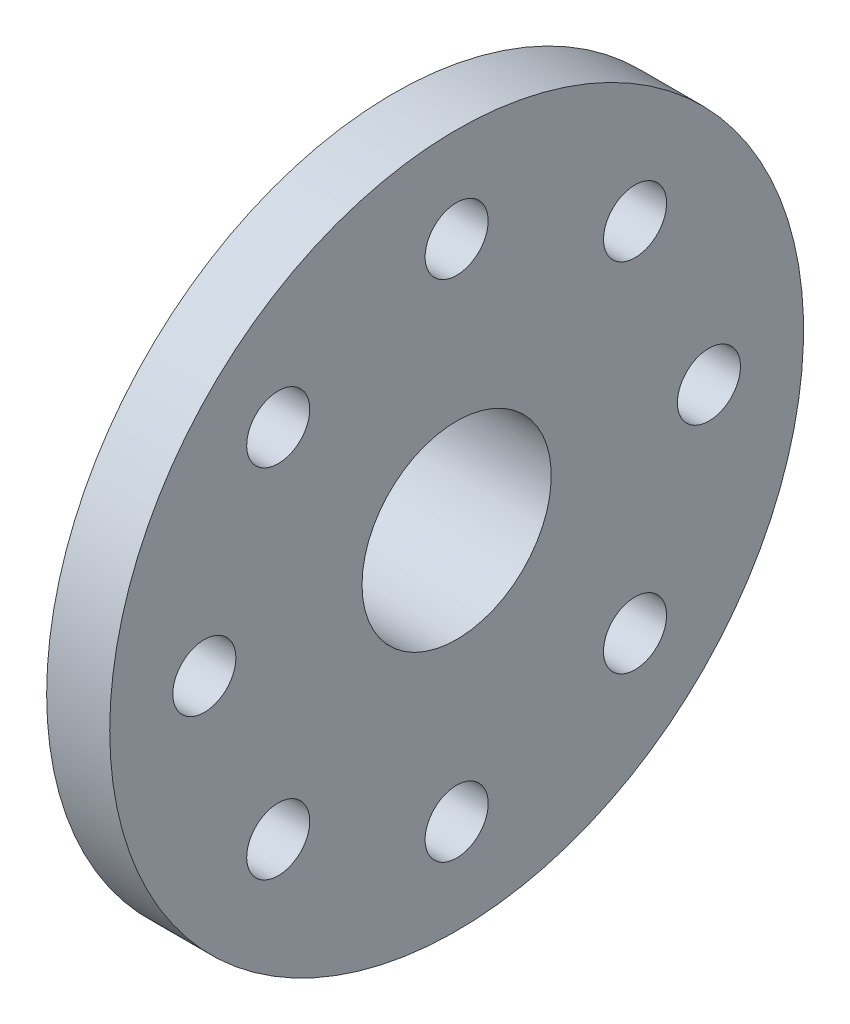
ISO-10303-21;
HEADER;
FILE_DESCRIPTION(('STEP AP214'),'2;1');
FILE_NAME('part.step','',(''),(''),'','','');
FILE_SCHEMA(('AUTOMOTIVE_DESIGN { 1 0 10303 214 1 1 1 1 }'));
ENDSEC;
DATA;
#1=APPLICATION_CONTEXT('core data for automotive mechanical design processes');
#2=APPLICATION_PROTOCOL_DEFINITION('international standard','automotive_design',2000,#1);
#3=PRODUCT_CONTEXT('',#1,'mechanical');
#4=PRODUCT('Part','Part','',(#3));
#5=PRODUCT_RELATED_PRODUCT_CATEGORY('part','',(#4));
#6=PRODUCT_DEFINITION_FORMATION('','',#4);
#7=PRODUCT_DEFINITION_CONTEXT('part definition',#1,'design');
#8=PRODUCT_DEFINITION('design','',#6,#7);
#9=PRODUCT_DEFINITION_SHAPE('','',#8);
#10=(LENGTH_UNIT() NAMED_UNIT(*) SI_UNIT(.MILLI.,.METRE.));
#11=(NAMED_UNIT(*) PLANE_ANGLE_UNIT() SI_UNIT($,.RADIAN.));
#12=(NAMED_UNIT(*) SI_UNIT($,.STERADIAN.) SOLID_ANGLE_UNIT());
#13=UNCERTAINTY_MEASURE_WITH_UNIT(LENGTH_MEASURE(1.E-05),#10,'distance_accuracy_value','');
#14=(GEOMETRIC_REPRESENTATION_CONTEXT(3) GLOBAL_UNCERTAINTY_ASSIGNED_CONTEXT((#13)) GLOBAL_UNIT_ASSIGNED_CONTEXT((#10,
#11,#12)) REPRESENTATION_CONTEXT('',''));
#15=CARTESIAN_POINT('',(0.,0.,0.));
#16=DIRECTION('',(0.,0.,1.));
#17=DIRECTION('',(1.,0.,0.));
#18=AXIS2_PLACEMENT_3D('',#15,#16,#17);
#19=CARTESIAN_POINT('',(1.,3.,0.));
#20=DIRECTION('',(-1.,0.,0.));
#21=DIRECTION('',(0.,0.,1.));
#22=AXIS2_PLACEMENT_3D('',#19,#20,#21);
#23=PLANE('',#22);
#24=CARTESIAN_POINT('',(1.,5.65685424949245,5.65685424949231));
#25=DIRECTION('',(-1.,0.,0.));
#26=DIRECTION('',(0.,-0.707106781186539,0.707106781186556));
#27=AXIS2_PLACEMENT_3D('',#24,#25,#26);
#28=CIRCLE('',#27,1.);
#29=CARTESIAN_POINT('',(1.,4.94974746830591,6.36396103067887));
#30=VERTEX_POINT('',#29);
#31=EDGE_CURVE('E85',#30,#30,#28,.T.);
#32=ORIENTED_EDGE('',*,*,#31,.T.);
#33=EDGE_LOOP('',(#32));
#34=FACE_BOUND('',#33,.T.);
#35=CARTESIAN_POINT('',(1.,0.,8.));
#36=DIRECTION('',(-1.,0.,0.));
#37=DIRECTION('',(0.,-1.,0.));
#38=AXIS2_PLACEMENT_3D('',#35,#36,#37);
#39=CIRCLE('',#38,1.);
#40=CARTESIAN_POINT('',(1.,-0.999999999999916,8.00000000000001));
#41=VERTEX_POINT('',#40);
#42=EDGE_CURVE('E79',#41,#41,#39,.T.);
#43=ORIENTED_EDGE('',*,*,#42,.T.);
#44=EDGE_LOOP('',(#43));
#45=FACE_BOUND('',#44,.T.);
#46=CARTESIAN_POINT('',(1.,-5.65685424949233,5.65685424949243));
#47=DIRECTION('',(-1.,0.,0.));
#48=DIRECTION('',(0.,-0.707106781186554,-0.707106781186541));
#49=AXIS2_PLACEMENT_3D('',#46,#47,#48);
#50=CIRCLE('',#49,1.);
#51=CARTESIAN_POINT('',(1.,-6.36396103067888,4.94974746830589));
#52=VERTEX_POINT('',#51);
#53=EDGE_CURVE('E73',#52,#52,#50,.T.);
#54=ORIENTED_EDGE('',*,*,#53,.T.);
#55=EDGE_LOOP('',(#54));
#56=FACE_BOUND('',#55,.T.);
#57=CARTESIAN_POINT('',(1.,-8.,0.));
#58=DIRECTION('',(-1.,0.,0.));
#59=DIRECTION('',(0.,0.,-1.));
#60=AXIS2_PLACEMENT_3D('',#57,#58,#59);
#61=CIRCLE('',#60,1.);
#62=CARTESIAN_POINT('',(1.,-8.,-1.));
#63=VERTEX_POINT('',#62);
#64=EDGE_CURVE('E67',#63,#63,#61,.T.);
#65=ORIENTED_EDGE('',*,*,#64,.T.);
#66=EDGE_LOOP('',(#65));
#67=FACE_BOUND('',#66,.T.);
#68=CARTESIAN_POINT('',(1.,-5.65685424949241,-5.65685424949235));
#69=DIRECTION('',(-1.,0.,0.));
#70=DIRECTION('',(0.,0.707106781186544,-0.707106781186551));
#71=AXIS2_PLACEMENT_3D('',#68,#69,#70);
#72=CIRCLE('',#71,1.);
#73=CARTESIAN_POINT('',(1.,-4.94974746830587,-6.3639610306789));
#74=VERTEX_POINT('',#73);
#75=EDGE_CURVE('E61',#74,#74,#72,.T.);
#76=ORIENTED_EDGE('',*,*,#75,.T.);
#77=EDGE_LOOP('',(#76));
#78=FACE_BOUND('',#77,.T.);
#79=CARTESIAN_POINT('',(1.,0.,-8.));
#80=DIRECTION('',(-1.,0.,0.));
#81=DIRECTION('',(0.,1.,0.));
#82=AXIS2_PLACEMENT_3D('',#79,#80,#81);
#83=CIRCLE('',#82,1.);
#84=CARTESIAN_POINT('',(1.,0.999999999999972,-8.));
#85=VERTEX_POINT('',#84);
#86=EDGE_CURVE('E55',#85,#85,#83,.T.);
#87=ORIENTED_EDGE('',*,*,#86,.T.);
#88=EDGE_LOOP('',(#87));
#89=FACE_BOUND('',#88,.T.);
#90=CARTESIAN_POINT('',(1.,5.65685424949237,-5.65685424949239));
#91=DIRECTION('',(-1.,0.,0.));
#92=DIRECTION('',(0.,0.707106781186549,0.707106781186546));
#93=AXIS2_PLACEMENT_3D('',#90,#91,#92);
#94=CIRCLE('',#93,1.);
#95=CARTESIAN_POINT('',(1.,6.36396103067892,-4.94974746830584));
#96=VERTEX_POINT('',#95);
#97=EDGE_CURVE('E49',#96,#96,#94,.T.);
#98=ORIENTED_EDGE('',*,*,#97,.T.);
#99=EDGE_LOOP('',(#98));
#100=FACE_BOUND('',#99,.T.);
#101=CARTESIAN_POINT('',(1.,8.,0.));
#102=DIRECTION('',(-1.,0.,0.));
#103=DIRECTION('',(0.,0.,1.));
#104=AXIS2_PLACEMENT_3D('',#101,#102,#103);
#105=CIRCLE('',#104,1.);
#106=CARTESIAN_POINT('',(1.,8.,1.));
#107=VERTEX_POINT('',#106);
#108=EDGE_CURVE('E45',#107,#107,#105,.T.);
#109=ORIENTED_EDGE('',*,*,#108,.T.);
#110=EDGE_LOOP('',(#109));
#111=FACE_BOUND('',#110,.T.);
#112=CARTESIAN_POINT('',(1.,0.,0.));
#113=DIRECTION('',(-1.,0.,0.));
#114=DIRECTION('',(0.,0.,1.));
#115=AXIS2_PLACEMENT_3D('',#112,#113,#114);
#116=CIRCLE('',#115,11.);
#117=CARTESIAN_POINT('',(1.,0.,11.));
#118=VERTEX_POINT('',#117);
#119=EDGE_CURVE('E10',#118,#118,#116,.T.);
#120=ORIENTED_EDGE('',*,*,#119,.F.);
#121=EDGE_LOOP('',(#120));
#122=FACE_BOUND('',#121,.T.);
#123=CARTESIAN_POINT('',(1.,0.,0.));
#124=DIRECTION('',(-1.,0.,0.));
#125=DIRECTION('',(0.,0.,1.));
#126=AXIS2_PLACEMENT_3D('',#123,#124,#125);
#127=CIRCLE('',#126,3.);
#128=CARTESIAN_POINT('',(1.,0.,3.));
#129=VERTEX_POINT('',#128);
#130=EDGE_CURVE('E42',#129,#129,#127,.T.);
#131=ORIENTED_EDGE('',*,*,#130,.T.);
#132=EDGE_LOOP('',(#131));
#133=FACE_BOUND('',#132,.T.);
#134=ADVANCED_FACE('F14',(#34,#45,#56,#67,#78,#89,#100,#111,#122,#133),#23,.F.);
#135=CARTESIAN_POINT('',(0.,0.,0.));
#136=DIRECTION('',(-1.,0.,0.));
#137=DIRECTION('',(0.,0.,1.));
#138=AXIS2_PLACEMENT_3D('',#135,#136,#137);
#139=CYLINDRICAL_SURFACE('',#138,11.);
#140=CARTESIAN_POINT('',(-1.,0.,0.));
#141=DIRECTION('',(-1.,0.,0.));
#142=DIRECTION('',(0.,0.,1.));
#143=AXIS2_PLACEMENT_3D('',#140,#141,#142);
#144=CIRCLE('',#143,11.);
#145=CARTESIAN_POINT('',(-1.,0.,11.));
#146=VERTEX_POINT('',#145);
#147=EDGE_CURVE('E20',#146,#146,#144,.T.);
#148=ORIENTED_EDGE('',*,*,#147,.F.);
#149=EDGE_LOOP('',(#148));
#150=FACE_BOUND('',#149,.T.);
#151=ORIENTED_EDGE('',*,*,#119,.T.);
#152=EDGE_LOOP('',(#151));
#153=FACE_BOUND('',#152,.T.);
#154=ADVANCED_FACE('F107',(#150,#153),#139,.T.);
#155=CARTESIAN_POINT('',(-1.,11.,0.));
#156=DIRECTION('',(1.,0.,0.));
#157=DIRECTION('',(0.,0.,-1.));
#158=AXIS2_PLACEMENT_3D('',#155,#156,#157);
#159=PLANE('',#158);
#160=CARTESIAN_POINT('',(-1.,5.65685424949245,5.65685424949231));
#161=DIRECTION('',(-1.,0.,0.));
#162=DIRECTION('',(0.,-0.707106781186539,0.707106781186556));
#163=AXIS2_PLACEMENT_3D('',#160,#161,#162);
#164=CIRCLE('',#163,1.);
#165=CARTESIAN_POINT('',(-1.,4.94974746830591,6.36396103067887));
#166=VERTEX_POINT('',#165);
#167=EDGE_CURVE('E88',#166,#166,#164,.T.);
#168=ORIENTED_EDGE('',*,*,#167,.F.);
#169=EDGE_LOOP('',(#168));
#170=FACE_BOUND('',#169,.T.);
#171=CARTESIAN_POINT('',(-1.,0.,8.));
#172=DIRECTION('',(-1.,0.,0.));
#173=DIRECTION('',(0.,-1.,0.));
#174=AXIS2_PLACEMENT_3D('',#171,#172,#173);
#175=CIRCLE('',#174,1.);
#176=CARTESIAN_POINT('',(-1.,-0.999999999999916,8.00000000000001));
#177=VERTEX_POINT('',#176);
#178=EDGE_CURVE('E82',#177,#177,#175,.T.);
#179=ORIENTED_EDGE('',*,*,#178,.F.);
#180=EDGE_LOOP('',(#179));
#181=FACE_BOUND('',#180,.T.);
#182=CARTESIAN_POINT('',(-1.,-5.65685424949233,5.65685424949243));
#183=DIRECTION('',(-1.,0.,0.));
#184=DIRECTION('',(0.,-0.707106781186554,-0.707106781186541));
#185=AXIS2_PLACEMENT_3D('',#182,#183,#184);
#186=CIRCLE('',#185,1.);
#187=CARTESIAN_POINT('',(-1.,-6.36396103067888,4.94974746830589));
#188=VERTEX_POINT('',#187);
#189=EDGE_CURVE('E76',#188,#188,#186,.T.);
#190=ORIENTED_EDGE('',*,*,#189,.F.);
#191=EDGE_LOOP('',(#190));
#192=FACE_BOUND('',#191,.T.);
#193=CARTESIAN_POINT('',(-1.,-8.,0.));
#194=DIRECTION('',(-1.,0.,0.));
#195=DIRECTION('',(0.,0.,-1.));
#196=AXIS2_PLACEMENT_3D('',#193,#194,#195);
#197=CIRCLE('',#196,1.);
#198=CARTESIAN_POINT('',(-1.,-8.,-1.));
#199=VERTEX_POINT('',#198);
#200=EDGE_CURVE('E70',#199,#199,#197,.T.);
#201=ORIENTED_EDGE('',*,*,#200,.F.);
#202=EDGE_LOOP('',(#201));
#203=FACE_BOUND('',#202,.T.);
#204=CARTESIAN_POINT('',(-1.,-5.65685424949241,-5.65685424949235));
#205=DIRECTION('',(-1.,0.,0.));
#206=DIRECTION('',(0.,0.707106781186544,-0.707106781186551));
#207=AXIS2_PLACEMENT_3D('',#204,#205,#206);
#208=CIRCLE('',#207,1.);
#209=CARTESIAN_POINT('',(-1.,-4.94974746830587,-6.3639610306789));
#210=VERTEX_POINT('',#209);
#211=EDGE_CURVE('E64',#210,#210,#208,.T.);
#212=ORIENTED_EDGE('',*,*,#211,.F.);
#213=EDGE_LOOP('',(#212));
#214=FACE_BOUND('',#213,.T.);
#215=CARTESIAN_POINT('',(-1.,0.,-8.));
#216=DIRECTION('',(-1.,0.,0.));
#217=DIRECTION('',(0.,1.,0.));
#218=AXIS2_PLACEMENT_3D('',#215,#216,#217);
#219=CIRCLE('',#218,1.);
#220=CARTESIAN_POINT('',(-1.,0.999999999999972,-8.));
#221=VERTEX_POINT('',#220);
#222=EDGE_CURVE('E58',#221,#221,#219,.T.);
#223=ORIENTED_EDGE('',*,*,#222,.F.);
#224=EDGE_LOOP('',(#223));
#225=FACE_BOUND('',#224,.T.);
#226=CARTESIAN_POINT('',(-1.,5.65685424949237,-5.65685424949239));
#227=DIRECTION('',(-1.,0.,0.));
#228=DIRECTION('',(0.,0.707106781186549,0.707106781186546));
#229=AXIS2_PLACEMENT_3D('',#226,#227,#228);
#230=CIRCLE('',#229,1.);
#231=CARTESIAN_POINT('',(-1.,6.36396103067892,-4.94974746830584));
#232=VERTEX_POINT('',#231);
#233=EDGE_CURVE('E52',#232,#232,#230,.T.);
#234=ORIENTED_EDGE('',*,*,#233,.F.);
#235=EDGE_LOOP('',(#234));
#236=FACE_BOUND('',#235,.T.);
#237=CARTESIAN_POINT('',(-1.,8.,0.));
#238=DIRECTION('',(-1.,0.,0.));
#239=DIRECTION('',(0.,0.,1.));
#240=AXIS2_PLACEMENT_3D('',#237,#238,#239);
#241=CIRCLE('',#240,1.);
#242=CARTESIAN_POINT('',(-1.,8.,1.));
#243=VERTEX_POINT('',#242);
#244=EDGE_CURVE('E46',#243,#243,#241,.T.);
#245=ORIENTED_EDGE('',*,*,#244,.F.);
#246=EDGE_LOOP('',(#245));
#247=FACE_BOUND('',#246,.T.);
#248=CARTESIAN_POINT('',(-1.,0.,0.));
#249=DIRECTION('',(-1.,0.,0.));
#250=DIRECTION('',(0.,0.,1.));
#251=AXIS2_PLACEMENT_3D('',#248,#249,#250);
#252=CIRCLE('',#251,3.75);
#253=CARTESIAN_POINT('',(-1.,0.,3.75));
#254=VERTEX_POINT('',#253);
#255=EDGE_CURVE('E24',#254,#254,#252,.T.);
#256=ORIENTED_EDGE('',*,*,#255,.F.);
#257=EDGE_LOOP('',(#256));
#258=FACE_BOUND('',#257,.T.);
#259=ORIENTED_EDGE('',*,*,#147,.T.);
#260=EDGE_LOOP('',(#259));
#261=FACE_BOUND('',#260,.T.);
#262=ADVANCED_FACE('F103',(#170,#181,#192,#203,#214,#225,#236,#247,#258,#261),#159,.F.);
#263=CARTESIAN_POINT('',(0.,0.,0.));
#264=DIRECTION('',(-1.,0.,0.));
#265=DIRECTION('',(0.,0.,1.));
#266=AXIS2_PLACEMENT_3D('',#263,#264,#265);
#267=CYLINDRICAL_SURFACE('',#266,3.75);
#268=CARTESIAN_POINT('',(-4.,0.,0.));
#269=DIRECTION('',(-1.,0.,0.));
#270=DIRECTION('',(0.,0.,1.));
#271=AXIS2_PLACEMENT_3D('',#268,#269,#270);
#272=CIRCLE('',#271,3.75);
#273=CARTESIAN_POINT('',(-4.,0.,3.75));
#274=VERTEX_POINT('',#273);
#275=EDGE_CURVE('E28',#274,#274,#272,.T.);
#276=ORIENTED_EDGE('',*,*,#275,.F.);
#277=EDGE_LOOP('',(#276));
#278=FACE_BOUND('',#277,.T.);
#279=ORIENTED_EDGE('',*,*,#255,.T.);
#280=EDGE_LOOP('',(#279));
#281=FACE_BOUND('',#280,.T.);
#282=ADVANCED_FACE('F106',(#278,#281),#267,.T.);
#283=CARTESIAN_POINT('',(-4.,3.75,0.));
#284=DIRECTION('',(1.,0.,0.));
#285=DIRECTION('',(0.,0.,-1.));
#286=AXIS2_PLACEMENT_3D('',#283,#284,#285);
#287=PLANE('',#286);
#288=CARTESIAN_POINT('',(-4.,0.,0.));
#289=DIRECTION('',(-1.,0.,0.));
#290=DIRECTION('',(0.,0.,1.));
#291=AXIS2_PLACEMENT_3D('',#288,#289,#290);
#292=CIRCLE('',#291,1.5);
#293=CARTESIAN_POINT('',(-4.,0.,1.5));
#294=VERTEX_POINT('',#293);
#295=EDGE_CURVE('E33',#294,#294,#292,.T.);
#296=ORIENTED_EDGE('',*,*,#295,.F.);
#297=EDGE_LOOP('',(#296));
#298=FACE_BOUND('',#297,.T.);
#299=ORIENTED_EDGE('',*,*,#275,.T.);
#300=EDGE_LOOP('',(#299));
#301=FACE_BOUND('',#300,.T.);
#302=ADVANCED_FACE('F126',(#298,#301),#287,.F.);
#303=CARTESIAN_POINT('',(0.,0.,0.));
#304=DIRECTION('',(-1.,0.,0.));
#305=DIRECTION('',(0.,0.,1.));
#306=AXIS2_PLACEMENT_3D('',#303,#304,#305);
#307=CYLINDRICAL_SURFACE('',#306,1.5);
#308=CARTESIAN_POINT('',(-3.5,0.,0.));
#309=DIRECTION('',(-1.,0.,0.));
#310=DIRECTION('',(0.,0.,1.));
#311=AXIS2_PLACEMENT_3D('',#308,#309,#310);
#312=CIRCLE('',#311,1.5);
#313=CARTESIAN_POINT('',(-3.5,0.,1.5));
#314=VERTEX_POINT('',#313);
#315=EDGE_CURVE('E36',#314,#314,#312,.T.);
#316=ORIENTED_EDGE('',*,*,#315,.F.);
#317=EDGE_LOOP('',(#316));
#318=FACE_BOUND('',#317,.T.);
#319=ORIENTED_EDGE('',*,*,#295,.T.);
#320=EDGE_LOOP('',(#319));
#321=FACE_BOUND('',#320,.T.);
#322=ADVANCED_FACE('F133',(#318,#321),#307,.F.);
#323=CARTESIAN_POINT('',(-3.5,3.,0.));
#324=DIRECTION('',(-1.,0.,0.));
#325=DIRECTION('',(0.,0.,1.));
#326=AXIS2_PLACEMENT_3D('',#323,#324,#325);
#327=PLANE('',#326);
#328=CARTESIAN_POINT('',(-3.5,0.,0.));
#329=DIRECTION('',(-1.,0.,0.));
#330=DIRECTION('',(0.,0.,1.));
#331=AXIS2_PLACEMENT_3D('',#328,#329,#330);
#332=CIRCLE('',#331,3.);
#333=CARTESIAN_POINT('',(-3.5,0.,3.));
#334=VERTEX_POINT('',#333);
#335=EDGE_CURVE('E39',#334,#334,#332,.T.);
#336=ORIENTED_EDGE('',*,*,#335,.F.);
#337=EDGE_LOOP('',(#336));
#338=FACE_BOUND('',#337,.T.);
#339=ORIENTED_EDGE('',*,*,#315,.T.);
#340=EDGE_LOOP('',(#339));
#341=FACE_BOUND('',#340,.T.);
#342=ADVANCED_FACE('F176',(#338,#341),#327,.F.);
#343=CARTESIAN_POINT('',(0.,0.,0.));
#344=DIRECTION('',(-1.,0.,0.));
#345=DIRECTION('',(0.,0.,1.));
#346=AXIS2_PLACEMENT_3D('',#343,#344,#345);
#347=CYLINDRICAL_SURFACE('',#346,3.);
#348=ORIENTED_EDGE('',*,*,#130,.F.);
#349=EDGE_LOOP('',(#348));
#350=FACE_BOUND('',#349,.T.);
#351=ORIENTED_EDGE('',*,*,#335,.T.);
#352=EDGE_LOOP('',(#351));
#353=FACE_BOUND('',#352,.T.);
#354=ADVANCED_FACE('F186',(#350,#353),#347,.F.);
#355=CARTESIAN_POINT('',(1.,8.,0.));
#356=DIRECTION('',(-1.,0.,0.));
#357=DIRECTION('',(0.,0.,1.));
#358=AXIS2_PLACEMENT_3D('',#355,#356,#357);
#359=CYLINDRICAL_SURFACE('',#358,1.);
#360=ORIENTED_EDGE('',*,*,#108,.F.);
#361=EDGE_LOOP('',(#360));
#362=FACE_BOUND('',#361,.T.);
#363=ORIENTED_EDGE('',*,*,#244,.T.);
#364=EDGE_LOOP('',(#363));
#365=FACE_BOUND('',#364,.T.);
#366=ADVANCED_FACE('F196',(#362,#365),#359,.F.);
#367=CARTESIAN_POINT('',(1.,5.65685424949237,-5.65685424949239));
#368=DIRECTION('',(-1.,0.,0.));
#369=DIRECTION('',(0.,0.,1.));
#370=AXIS2_PLACEMENT_3D('',#367,#368,#369);
#371=CYLINDRICAL_SURFACE('',#370,1.);
#372=ORIENTED_EDGE('',*,*,#97,.F.);
#373=EDGE_LOOP('',(#372));
#374=FACE_BOUND('',#373,.T.);
#375=ORIENTED_EDGE('',*,*,#233,.T.);
#376=EDGE_LOOP('',(#375));
#377=FACE_BOUND('',#376,.T.);
#378=ADVANCED_FACE('F206',(#374,#377),#371,.F.);
#379=CARTESIAN_POINT('',(1.,0.,-8.));
#380=DIRECTION('',(-1.,0.,0.));
#381=DIRECTION('',(0.,0.,1.));
#382=AXIS2_PLACEMENT_3D('',#379,#380,#381);
#383=CYLINDRICAL_SURFACE('',#382,1.);
#384=ORIENTED_EDGE('',*,*,#86,.F.);
#385=EDGE_LOOP('',(#384));
#386=FACE_BOUND('',#385,.T.);
#387=ORIENTED_EDGE('',*,*,#222,.T.);
#388=EDGE_LOOP('',(#387));
#389=FACE_BOUND('',#388,.T.);
#390=ADVANCED_FACE('F217',(#386,#389),#383,.F.);
#391=CARTESIAN_POINT('',(1.,-5.65685424949241,-5.65685424949235));
#392=DIRECTION('',(-1.,0.,0.));
#393=DIRECTION('',(0.,0.,1.));
#394=AXIS2_PLACEMENT_3D('',#391,#392,#393);
#395=CYLINDRICAL_SURFACE('',#394,1.);
#396=ORIENTED_EDGE('',*,*,#75,.F.);
#397=EDGE_LOOP('',(#396));
#398=FACE_BOUND('',#397,.T.);
#399=ORIENTED_EDGE('',*,*,#211,.T.);
#400=EDGE_LOOP('',(#399));
#401=FACE_BOUND('',#400,.T.);
#402=ADVANCED_FACE('F227',(#398,#401),#395,.F.);
#403=CARTESIAN_POINT('',(1.,-8.,0.));
#404=DIRECTION('',(-1.,0.,0.));
#405=DIRECTION('',(0.,0.,1.));
#406=AXIS2_PLACEMENT_3D('',#403,#404,#405);
#407=CYLINDRICAL_SURFACE('',#406,1.);
#408=ORIENTED_EDGE('',*,*,#64,.F.);
#409=EDGE_LOOP('',(#408));
#410=FACE_BOUND('',#409,.T.);
#411=ORIENTED_EDGE('',*,*,#200,.T.);
#412=EDGE_LOOP('',(#411));
#413=FACE_BOUND('',#412,.T.);
#414=ADVANCED_FACE('F237',(#410,#413),#407,.F.);
#415=CARTESIAN_POINT('',(1.,-5.65685424949233,5.65685424949243));
#416=DIRECTION('',(-1.,0.,0.));
#417=DIRECTION('',(0.,0.,1.));
#418=AXIS2_PLACEMENT_3D('',#415,#416,#417);
#419=CYLINDRICAL_SURFACE('',#418,1.);
#420=ORIENTED_EDGE('',*,*,#53,.F.);
#421=EDGE_LOOP('',(#420));
#422=FACE_BOUND('',#421,.T.);
#423=ORIENTED_EDGE('',*,*,#189,.T.);
#424=EDGE_LOOP('',(#423));
#425=FACE_BOUND('',#424,.T.);
#426=ADVANCED_FACE('F247',(#422,#425),#419,.F.);
#427=CARTESIAN_POINT('',(1.,0.,8.));
#428=DIRECTION('',(-1.,0.,0.));
#429=DIRECTION('',(0.,0.,1.));
#430=AXIS2_PLACEMENT_3D('',#427,#428,#429);
#431=CYLINDRICAL_SURFACE('',#430,1.);
#432=ORIENTED_EDGE('',*,*,#42,.F.);
#433=EDGE_LOOP('',(#432));
#434=FACE_BOUND('',#433,.T.);
#435=ORIENTED_EDGE('',*,*,#178,.T.);
#436=EDGE_LOOP('',(#435));
#437=FACE_BOUND('',#436,.T.);
#438=ADVANCED_FACE('F99',(#434,#437),#431,.F.);
#439=CARTESIAN_POINT('',(1.,5.65685424949245,5.65685424949231));
#440=DIRECTION('',(-1.,0.,0.));
#441=DIRECTION('',(0.,0.,1.));
#442=AXIS2_PLACEMENT_3D('',#439,#440,#441);
#443=CYLINDRICAL_SURFACE('',#442,1.);
#444=ORIENTED_EDGE('',*,*,#31,.F.);
#445=EDGE_LOOP('',(#444));
#446=FACE_BOUND('',#445,.T.);
#447=ORIENTED_EDGE('',*,*,#167,.T.);
#448=EDGE_LOOP('',(#447));
#449=FACE_BOUND('',#448,.T.);
#450=ADVANCED_FACE('F96',(#446,#449),#443,.F.);
#451=CLOSED_SHELL('',(#134,#154,#262,#282,#302,#322,#342,#354,#366,#378,#390,#402,#414,#426,
#438,#450));
#452=MANIFOLD_SOLID_BREP('B1',#451);
#453=ADVANCED_BREP_SHAPE_REPRESENTATION('',(#18,#452),#14);
#454=SHAPE_DEFINITION_REPRESENTATION(#9,#453);
ENDSEC;
END-ISO-10303-21;
